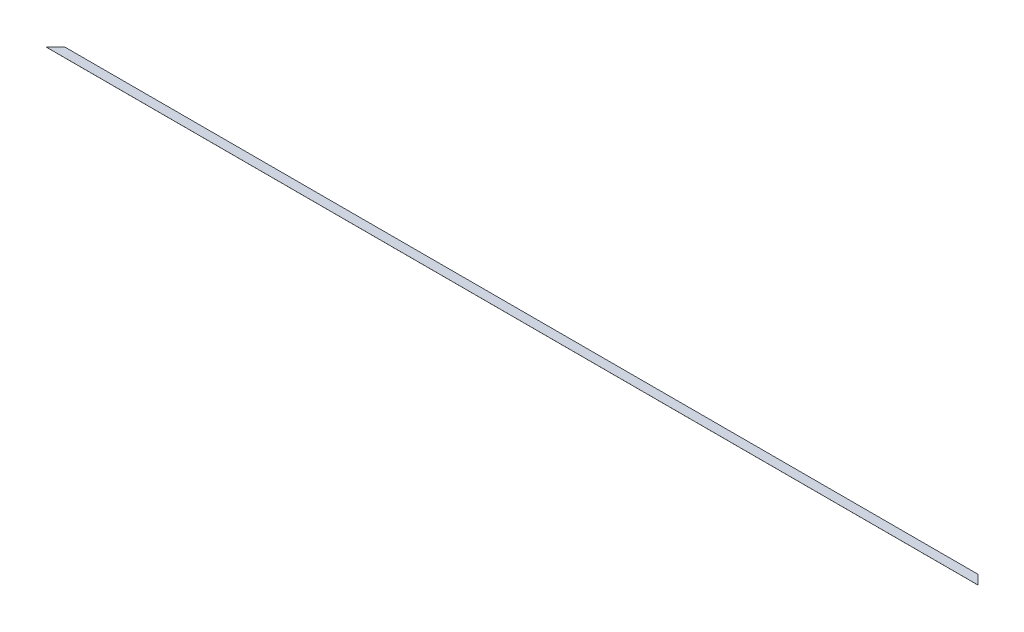
ISO-10303-21;
HEADER;
FILE_DESCRIPTION(('STEP AP214'),'2;1');
FILE_NAME('part.step','',(''),(''),'','','');
FILE_SCHEMA(('AUTOMOTIVE_DESIGN { 1 0 10303 214 1 1 1 1 }'));
ENDSEC;
DATA;
#1=APPLICATION_CONTEXT('core data for automotive mechanical design processes');
#2=APPLICATION_PROTOCOL_DEFINITION('international standard','automotive_design',2000,#1);
#3=PRODUCT_CONTEXT('',#1,'mechanical');
#4=PRODUCT('Part','Part','',(#3));
#5=PRODUCT_RELATED_PRODUCT_CATEGORY('part','',(#4));
#6=PRODUCT_DEFINITION_FORMATION('','',#4);
#7=PRODUCT_DEFINITION_CONTEXT('part definition',#1,'design');
#8=PRODUCT_DEFINITION('design','',#6,#7);
#9=PRODUCT_DEFINITION_SHAPE('','',#8);
#10=(LENGTH_UNIT() NAMED_UNIT(*) SI_UNIT(.MILLI.,.METRE.));
#11=(NAMED_UNIT(*) PLANE_ANGLE_UNIT() SI_UNIT($,.RADIAN.));
#12=(NAMED_UNIT(*) SI_UNIT($,.STERADIAN.) SOLID_ANGLE_UNIT());
#13=UNCERTAINTY_MEASURE_WITH_UNIT(LENGTH_MEASURE(1.E-05),#10,'distance_accuracy_value','');
#14=(GEOMETRIC_REPRESENTATION_CONTEXT(3) GLOBAL_UNCERTAINTY_ASSIGNED_CONTEXT((#13)) GLOBAL_UNIT_ASSIGNED_CONTEXT((#10,
#11,#12)) REPRESENTATION_CONTEXT('',''));
#15=CARTESIAN_POINT('',(0.,0.,0.));
#16=DIRECTION('',(0.,0.,1.));
#17=DIRECTION('',(1.,0.,0.));
#18=AXIS2_PLACEMENT_3D('',#15,#16,#17);
#19=CARTESIAN_POINT('',(0.,0.,0.));
#20=DIRECTION('',(0.,-1.,0.));
#21=DIRECTION('',(0.,0.,-1.));
#22=AXIS2_PLACEMENT_3D('',#19,#20,#21);
#23=PLANE('',#22);
#24=DIRECTION('',(0.707106781186552,0.,0.707106781186543));
#25=VECTOR('',#24,1.);
#26=CARTESIAN_POINT('',(2540.,0.,0.));
#27=LINE('',#26,#25);
#28=CARTESIAN_POINT('',(2489.2,0.,-50.7999999999999));
#29=VERTEX_POINT('',#28);
#30=CARTESIAN_POINT('',(2540.,0.,0.));
#31=VERTEX_POINT('',#30);
#32=EDGE_CURVE('E55',#29,#31,#27,.T.);
#33=ORIENTED_EDGE('',*,*,#32,.T.);
#34=DIRECTION('',(-1.,0.,0.));
#35=VECTOR('',#34,1.);
#36=CARTESIAN_POINT('',(-2540.,0.,0.));
#37=LINE('',#36,#35);
#38=CARTESIAN_POINT('',(-2540.,0.,0.));
#39=VERTEX_POINT('',#38);
#40=EDGE_CURVE('E76',#31,#39,#37,.T.);
#41=ORIENTED_EDGE('',*,*,#40,.T.);
#42=DIRECTION('',(0.707106781186553,0.,-0.707106781186542));
#43=VECTOR('',#42,1.);
#44=CARTESIAN_POINT('',(-2489.2,0.,-50.7999999999994));
#45=LINE('',#44,#43);
#46=CARTESIAN_POINT('',(-2489.2,0.,-50.7999999999994));
#47=VERTEX_POINT('',#46);
#48=EDGE_CURVE('E58',#39,#47,#45,.T.);
#49=ORIENTED_EDGE('',*,*,#48,.T.);
#50=DIRECTION('',(1.,0.,0.));
#51=VECTOR('',#50,1.);
#52=CARTESIAN_POINT('',(2489.2,0.,-50.8));
#53=LINE('',#52,#51);
#54=EDGE_CURVE('E20',#47,#29,#53,.T.);
#55=ORIENTED_EDGE('',*,*,#54,.T.);
#56=EDGE_LOOP('',(#33,#41,#49,#55));
#57=FACE_BOUND('',#56,.T.);
#58=ADVANCED_FACE('F17',(#57),#23,.T.);
#59=CARTESIAN_POINT('',(2489.2,0.254,-50.8));
#60=DIRECTION('',(0.,0.,1.));
#61=DIRECTION('',(1.,0.,0.));
#62=AXIS2_PLACEMENT_3D('',#59,#60,#61);
#63=PLANE('',#62);
#64=DIRECTION('',(0.,1.,0.));
#65=VECTOR('',#64,1.);
#66=CARTESIAN_POINT('',(-2489.2,0.254,-50.7999999999994));
#67=LINE('',#66,#65);
#68=CARTESIAN_POINT('',(-2489.2,0.254,-50.7999999999994));
#69=VERTEX_POINT('',#68);
#70=EDGE_CURVE('E78',#47,#69,#67,.T.);
#71=ORIENTED_EDGE('',*,*,#70,.T.);
#72=DIRECTION('',(1.,0.,0.));
#73=VECTOR('',#72,1.);
#74=CARTESIAN_POINT('',(0.,0.254,-50.7999999999994));
#75=LINE('',#74,#73);
#76=CARTESIAN_POINT('',(2489.2,0.254,-50.7999999999999));
#77=VERTEX_POINT('',#76);
#78=EDGE_CURVE('E73',#69,#77,#75,.T.);
#79=ORIENTED_EDGE('',*,*,#78,.T.);
#80=DIRECTION('',(0.,1.,0.));
#81=VECTOR('',#80,1.);
#82=CARTESIAN_POINT('',(2489.2,0.254,-50.8));
#83=LINE('',#82,#81);
#84=EDGE_CURVE('E63',#77,#29,#83,.F.);
#85=ORIENTED_EDGE('',*,*,#84,.T.);
#86=ORIENTED_EDGE('',*,*,#54,.F.);
#87=EDGE_LOOP('',(#71,#79,#85,#86));
#88=FACE_BOUND('',#87,.T.);
#89=ADVANCED_FACE('F72',(#88),#63,.F.);
#90=CARTESIAN_POINT('',(2540.,0.254,0.));
#91=DIRECTION('',(-0.707106781186543,0.,0.707106781186552));
#92=DIRECTION('',(0.707106781186552,0.,0.707106781186543));
#93=AXIS2_PLACEMENT_3D('',#90,#91,#92);
#94=PLANE('',#93);
#95=ORIENTED_EDGE('',*,*,#84,.F.);
#96=DIRECTION('',(0.707106781186552,0.,0.707106781186543));
#97=VECTOR('',#96,1.);
#98=CARTESIAN_POINT('',(2489.2,0.254,-50.8));
#99=LINE('',#98,#97);
#100=CARTESIAN_POINT('',(2540.,0.254,0.));
#101=VERTEX_POINT('',#100);
#102=EDGE_CURVE('E83',#77,#101,#99,.T.);
#103=ORIENTED_EDGE('',*,*,#102,.T.);
#104=DIRECTION('',(0.,1.,0.));
#105=VECTOR('',#104,1.);
#106=CARTESIAN_POINT('',(2540.,0.254,0.));
#107=LINE('',#106,#105);
#108=EDGE_CURVE('E69',#101,#31,#107,.F.);
#109=ORIENTED_EDGE('',*,*,#108,.T.);
#110=ORIENTED_EDGE('',*,*,#32,.F.);
#111=EDGE_LOOP('',(#95,#103,#109,#110));
#112=FACE_BOUND('',#111,.T.);
#113=ADVANCED_FACE('F66',(#112),#94,.F.);
#114=CARTESIAN_POINT('',(-2540.,0.254,0.));
#115=DIRECTION('',(0.,0.,-1.));
#116=DIRECTION('',(-1.,0.,0.));
#117=AXIS2_PLACEMENT_3D('',#114,#115,#116);
#118=PLANE('',#117);
#119=ORIENTED_EDGE('',*,*,#108,.F.);
#120=DIRECTION('',(1.,0.,0.));
#121=VECTOR('',#120,1.);
#122=CARTESIAN_POINT('',(0.,0.254,0.));
#123=LINE('',#122,#121);
#124=CARTESIAN_POINT('',(-2540.,0.254,0.));
#125=VERTEX_POINT('',#124);
#126=EDGE_CURVE('E26',#101,#125,#123,.F.);
#127=ORIENTED_EDGE('',*,*,#126,.T.);
#128=DIRECTION('',(0.,1.,0.));
#129=VECTOR('',#128,1.);
#130=CARTESIAN_POINT('',(-2540.,0.254,0.));
#131=LINE('',#130,#129);
#132=EDGE_CURVE('E34',#125,#39,#131,.F.);
#133=ORIENTED_EDGE('',*,*,#132,.T.);
#134=ORIENTED_EDGE('',*,*,#40,.F.);
#135=EDGE_LOOP('',(#119,#127,#133,#134));
#136=FACE_BOUND('',#135,.T.);
#137=ADVANCED_FACE('F88',(#136),#118,.F.);
#138=CARTESIAN_POINT('',(-2489.2,0.254,-50.7999999999994));
#139=DIRECTION('',(0.707106781186542,0.,0.707106781186553));
#140=DIRECTION('',(0.707106781186553,0.,-0.707106781186542));
#141=AXIS2_PLACEMENT_3D('',#138,#139,#140);
#142=PLANE('',#141);
#143=ORIENTED_EDGE('',*,*,#132,.F.);
#144=DIRECTION('',(0.707106781186553,0.,-0.707106781186542));
#145=VECTOR('',#144,1.);
#146=CARTESIAN_POINT('',(-2540.,0.254,0.));
#147=LINE('',#146,#145);
#148=EDGE_CURVE('E11',#125,#69,#147,.T.);
#149=ORIENTED_EDGE('',*,*,#148,.T.);
#150=ORIENTED_EDGE('',*,*,#70,.F.);
#151=ORIENTED_EDGE('',*,*,#48,.F.);
#152=EDGE_LOOP('',(#143,#149,#150,#151));
#153=FACE_BOUND('',#152,.T.);
#154=ADVANCED_FACE('F91',(#153),#142,.F.);
#155=CARTESIAN_POINT('',(0.,0.254,0.));
#156=DIRECTION('',(0.,-1.,0.));
#157=DIRECTION('',(0.,0.,-1.));
#158=AXIS2_PLACEMENT_3D('',#155,#156,#157);
#159=PLANE('',#158);
#160=ORIENTED_EDGE('',*,*,#126,.F.);
#161=ORIENTED_EDGE('',*,*,#102,.F.);
#162=ORIENTED_EDGE('',*,*,#78,.F.);
#163=ORIENTED_EDGE('',*,*,#148,.F.);
#164=EDGE_LOOP('',(#160,#161,#162,#163));
#165=FACE_BOUND('',#164,.T.);
#166=ADVANCED_FACE('F90',(#165),#159,.F.);
#167=CLOSED_SHELL('',(#58,#89,#113,#137,#154,#166));
#168=MANIFOLD_SOLID_BREP('B1',#167);
#169=ADVANCED_BREP_SHAPE_REPRESENTATION('',(#18,#168),#14);
#170=SHAPE_DEFINITION_REPRESENTATION(#9,#169);
ENDSEC;
END-ISO-10303-21;
